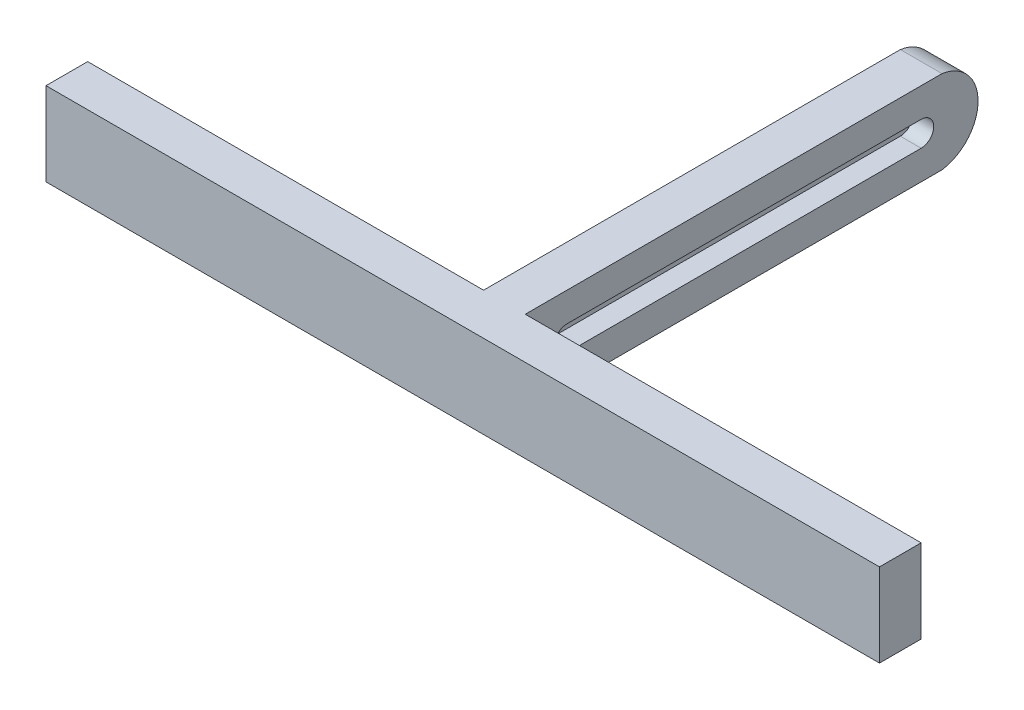
ISO-10303-21;
HEADER;
FILE_DESCRIPTION(('STEP AP214'),'2;1');
FILE_NAME('part.step','',(''),(''),'','','');
FILE_SCHEMA(('AUTOMOTIVE_DESIGN { 1 0 10303 214 1 1 1 1 }'));
ENDSEC;
DATA;
#1=APPLICATION_CONTEXT('core data for automotive mechanical design processes');
#2=APPLICATION_PROTOCOL_DEFINITION('international standard','automotive_design',2000,#1);
#3=PRODUCT_CONTEXT('',#1,'mechanical');
#4=PRODUCT('Part','Part','',(#3));
#5=PRODUCT_RELATED_PRODUCT_CATEGORY('part','',(#4));
#6=PRODUCT_DEFINITION_FORMATION('','',#4);
#7=PRODUCT_DEFINITION_CONTEXT('part definition',#1,'design');
#8=PRODUCT_DEFINITION('design','',#6,#7);
#9=PRODUCT_DEFINITION_SHAPE('','',#8);
#10=(LENGTH_UNIT() NAMED_UNIT(*) SI_UNIT(.MILLI.,.METRE.));
#11=(NAMED_UNIT(*) PLANE_ANGLE_UNIT() SI_UNIT($,.RADIAN.));
#12=(NAMED_UNIT(*) SI_UNIT($,.STERADIAN.) SOLID_ANGLE_UNIT());
#13=UNCERTAINTY_MEASURE_WITH_UNIT(LENGTH_MEASURE(1.E-05),#10,'distance_accuracy_value','');
#14=(GEOMETRIC_REPRESENTATION_CONTEXT(3) GLOBAL_UNCERTAINTY_ASSIGNED_CONTEXT((#13)) GLOBAL_UNIT_ASSIGNED_CONTEXT((#10,
#11,#12)) REPRESENTATION_CONTEXT('',''));
#15=CARTESIAN_POINT('',(0.,0.,0.));
#16=DIRECTION('',(0.,0.,1.));
#17=DIRECTION('',(1.,0.,0.));
#18=AXIS2_PLACEMENT_3D('',#15,#16,#17);
#19=CARTESIAN_POINT('',(5.,-10.,50.));
#20=DIRECTION('',(0.,1.,0.));
#21=DIRECTION('',(0.,0.,1.));
#22=AXIS2_PLACEMENT_3D('',#19,#20,#21);
#23=PLANE('',#22);
#24=DIRECTION('',(0.,0.,-1.));
#25=VECTOR('',#24,1.);
#26=CARTESIAN_POINT('',(-5.,-10.,50.));
#27=LINE('',#26,#25);
#28=CARTESIAN_POINT('',(-5.,-10.,50.));
#29=VERTEX_POINT('',#28);
#30=CARTESIAN_POINT('',(-5.,-10.,-50.));
#31=VERTEX_POINT('',#30);
#32=EDGE_CURVE('E228',#29,#31,#27,.T.);
#33=ORIENTED_EDGE('',*,*,#32,.T.);
#34=DIRECTION('',(-1.,0.,0.));
#35=VECTOR('',#34,1.);
#36=CARTESIAN_POINT('',(5.,-10.,-50.));
#37=LINE('',#36,#35);
#38=CARTESIAN_POINT('',(5.,-10.,-50.));
#39=VERTEX_POINT('',#38);
#40=EDGE_CURVE('E11',#39,#31,#37,.T.);
#41=ORIENTED_EDGE('',*,*,#40,.F.);
#42=DIRECTION('',(0.,0.,-1.));
#43=VECTOR('',#42,1.);
#44=CARTESIAN_POINT('',(5.,-10.,50.));
#45=LINE('',#44,#43);
#46=CARTESIAN_POINT('',(5.,-10.,50.));
#47=VERTEX_POINT('',#46);
#48=EDGE_CURVE('E218',#47,#39,#45,.T.);
#49=ORIENTED_EDGE('',*,*,#48,.F.);
#50=DIRECTION('',(-1.,0.,0.));
#51=VECTOR('',#50,1.);
#52=CARTESIAN_POINT('',(100.,-10.,50.));
#53=LINE('',#52,#51);
#54=CARTESIAN_POINT('',(100.,-10.,50.));
#55=VERTEX_POINT('',#54);
#56=EDGE_CURVE('E69',#55,#47,#53,.T.);
#57=ORIENTED_EDGE('',*,*,#56,.F.);
#58=DIRECTION('',(0.,0.,-1.));
#59=VECTOR('',#58,1.);
#60=CARTESIAN_POINT('',(100.,-10.,50.));
#61=LINE('',#60,#59);
#62=CARTESIAN_POINT('',(100.,-10.,60.));
#63=VERTEX_POINT('',#62);
#64=EDGE_CURVE('E152',#63,#55,#61,.T.);
#65=ORIENTED_EDGE('',*,*,#64,.F.);
#66=DIRECTION('',(-1.,0.,0.));
#67=VECTOR('',#66,1.);
#68=CARTESIAN_POINT('',(100.,-10.,60.));
#69=LINE('',#68,#67);
#70=CARTESIAN_POINT('',(-100.,-10.,60.));
#71=VERTEX_POINT('',#70);
#72=EDGE_CURVE('E257',#63,#71,#69,.T.);
#73=ORIENTED_EDGE('',*,*,#72,.T.);
#74=DIRECTION('',(0.,0.,-1.));
#75=VECTOR('',#74,1.);
#76=CARTESIAN_POINT('',(-100.,-10.,50.));
#77=LINE('',#76,#75);
#78=CARTESIAN_POINT('',(-100.,-10.,50.));
#79=VERTEX_POINT('',#78);
#80=EDGE_CURVE('E154',#71,#79,#77,.T.);
#81=ORIENTED_EDGE('',*,*,#80,.T.);
#82=EDGE_CURVE('E246',#29,#79,#53,.T.);
#83=ORIENTED_EDGE('',*,*,#82,.F.);
#84=EDGE_LOOP('',(#33,#41,#49,#57,#65,#73,#81,#83));
#85=FACE_BOUND('',#84,.T.);
#86=ADVANCED_FACE('F45',(#85),#23,.F.);
#87=CARTESIAN_POINT('',(5.,10.,50.));
#88=DIRECTION('',(0.,-1.,0.));
#89=DIRECTION('',(0.,0.,-1.));
#90=AXIS2_PLACEMENT_3D('',#87,#88,#89);
#91=PLANE('',#90);
#92=DIRECTION('',(0.,0.,1.));
#93=VECTOR('',#92,1.);
#94=CARTESIAN_POINT('',(-5.,10.,50.));
#95=LINE('',#94,#93);
#96=CARTESIAN_POINT('',(-5.,10.,-50.));
#97=VERTEX_POINT('',#96);
#98=CARTESIAN_POINT('',(-5.,10.,50.));
#99=VERTEX_POINT('',#98);
#100=EDGE_CURVE('E219',#97,#99,#95,.T.);
#101=ORIENTED_EDGE('',*,*,#100,.T.);
#102=DIRECTION('',(-1.,0.,0.));
#103=VECTOR('',#102,1.);
#104=CARTESIAN_POINT('',(100.,10.,50.));
#105=LINE('',#104,#103);
#106=CARTESIAN_POINT('',(-100.,10.,50.));
#107=VERTEX_POINT('',#106);
#108=EDGE_CURVE('E160',#99,#107,#105,.T.);
#109=ORIENTED_EDGE('',*,*,#108,.T.);
#110=DIRECTION('',(0.,0.,1.));
#111=VECTOR('',#110,1.);
#112=CARTESIAN_POINT('',(-100.,10.,50.));
#113=LINE('',#112,#111);
#114=CARTESIAN_POINT('',(-100.,10.,60.));
#115=VERTEX_POINT('',#114);
#116=EDGE_CURVE('E271',#107,#115,#113,.T.);
#117=ORIENTED_EDGE('',*,*,#116,.T.);
#118=DIRECTION('',(-1.,0.,0.));
#119=VECTOR('',#118,1.);
#120=CARTESIAN_POINT('',(100.,10.,60.));
#121=LINE('',#120,#119);
#122=CARTESIAN_POINT('',(100.,10.,60.));
#123=VERTEX_POINT('',#122);
#124=EDGE_CURVE('E143',#123,#115,#121,.T.);
#125=ORIENTED_EDGE('',*,*,#124,.F.);
#126=DIRECTION('',(0.,0.,1.));
#127=VECTOR('',#126,1.);
#128=CARTESIAN_POINT('',(100.,10.,50.));
#129=LINE('',#128,#127);
#130=CARTESIAN_POINT('',(100.,10.,50.));
#131=VERTEX_POINT('',#130);
#132=EDGE_CURVE('E134',#131,#123,#129,.T.);
#133=ORIENTED_EDGE('',*,*,#132,.F.);
#134=CARTESIAN_POINT('',(5.,10.,50.));
#135=VERTEX_POINT('',#134);
#136=EDGE_CURVE('E140',#131,#135,#105,.T.);
#137=ORIENTED_EDGE('',*,*,#136,.T.);
#138=DIRECTION('',(0.,0.,1.));
#139=VECTOR('',#138,1.);
#140=CARTESIAN_POINT('',(5.,10.,50.));
#141=LINE('',#140,#139);
#142=CARTESIAN_POINT('',(5.,10.,-50.));
#143=VERTEX_POINT('',#142);
#144=EDGE_CURVE('E223',#143,#135,#141,.T.);
#145=ORIENTED_EDGE('',*,*,#144,.F.);
#146=DIRECTION('',(-1.,0.,0.));
#147=VECTOR('',#146,1.);
#148=CARTESIAN_POINT('',(5.,10.,-50.));
#149=LINE('',#148,#147);
#150=EDGE_CURVE('E53',#143,#97,#149,.T.);
#151=ORIENTED_EDGE('',*,*,#150,.T.);
#152=EDGE_LOOP('',(#101,#109,#117,#125,#133,#137,#145,#151));
#153=FACE_BOUND('',#152,.T.);
#154=ADVANCED_FACE('F137',(#153),#91,.F.);
#155=CARTESIAN_POINT('',(5.,0.,0.));
#156=DIRECTION('',(1.,0.,0.));
#157=DIRECTION('',(0.,0.,-1.));
#158=AXIS2_PLACEMENT_3D('',#155,#156,#157);
#159=PLANE('',#158);
#160=CARTESIAN_POINT('',(5.,0.,40.));
#161=DIRECTION('',(1.,0.,0.));
#162=DIRECTION('',(0.,0.,-1.));
#163=AXIS2_PLACEMENT_3D('',#160,#161,#162);
#164=CIRCLE('',#163,3.);
#165=CARTESIAN_POINT('',(5.,3.,40.));
#166=VERTEX_POINT('',#165);
#167=CARTESIAN_POINT('',(5.,-3.,40.));
#168=VERTEX_POINT('',#167);
#169=EDGE_CURVE('E60',#166,#168,#164,.T.);
#170=ORIENTED_EDGE('',*,*,#169,.F.);
#171=DIRECTION('',(0.,0.,1.));
#172=VECTOR('',#171,1.);
#173=CARTESIAN_POINT('',(5.,3.,40.));
#174=LINE('',#173,#172);
#175=CARTESIAN_POINT('',(5.,3.,-45.));
#176=VERTEX_POINT('',#175);
#177=EDGE_CURVE('E174',#176,#166,#174,.T.);
#178=ORIENTED_EDGE('',*,*,#177,.F.);
#179=CARTESIAN_POINT('',(5.,0.,-45.));
#180=DIRECTION('',(1.,0.,0.));
#181=DIRECTION('',(0.,0.,1.));
#182=AXIS2_PLACEMENT_3D('',#179,#180,#181);
#183=CIRCLE('',#182,3.);
#184=CARTESIAN_POINT('',(5.,-3.,-45.));
#185=VERTEX_POINT('',#184);
#186=EDGE_CURVE('E190',#185,#176,#183,.T.);
#187=ORIENTED_EDGE('',*,*,#186,.F.);
#188=DIRECTION('',(0.,0.,-1.));
#189=VECTOR('',#188,1.);
#190=CARTESIAN_POINT('',(5.,-3.,40.));
#191=LINE('',#190,#189);
#192=EDGE_CURVE('E164',#168,#185,#191,.T.);
#193=ORIENTED_EDGE('',*,*,#192,.F.);
#194=EDGE_LOOP('',(#170,#178,#187,#193));
#195=FACE_BOUND('',#194,.T.);
#196=ORIENTED_EDGE('',*,*,#48,.T.);
#197=CARTESIAN_POINT('',(5.,0.,-48.555144550315));
#198=DIRECTION('',(-1.,0.,0.));
#199=DIRECTION('',(0.,0.,1.));
#200=AXIS2_PLACEMENT_3D('',#197,#198,#199);
#201=CIRCLE('',#200,10.1038412136417);
#202=EDGE_CURVE('E209',#143,#39,#201,.T.);
#203=ORIENTED_EDGE('',*,*,#202,.F.);
#204=ORIENTED_EDGE('',*,*,#144,.T.);
#205=DIRECTION('',(0.,-1.,0.));
#206=VECTOR('',#205,1.);
#207=CARTESIAN_POINT('',(5.,10.,50.));
#208=LINE('',#207,#206);
#209=EDGE_CURVE('E158',#135,#47,#208,.T.);
#210=ORIENTED_EDGE('',*,*,#209,.T.);
#211=EDGE_LOOP('',(#196,#203,#204,#210));
#212=FACE_BOUND('',#211,.T.);
#213=ADVANCED_FACE('F282',(#195,#212),#159,.T.);
#214=CARTESIAN_POINT('',(-5.,0.,0.));
#215=DIRECTION('',(1.,0.,0.));
#216=DIRECTION('',(0.,0.,-1.));
#217=AXIS2_PLACEMENT_3D('',#214,#215,#216);
#218=PLANE('',#217);
#219=ORIENTED_EDGE('',*,*,#100,.F.);
#220=CARTESIAN_POINT('',(-5.,0.,-48.555144550315));
#221=DIRECTION('',(-1.,0.,0.));
#222=DIRECTION('',(0.,0.,1.));
#223=AXIS2_PLACEMENT_3D('',#220,#221,#222);
#224=CIRCLE('',#223,10.1038412136417);
#225=EDGE_CURVE('E200',#97,#31,#224,.T.);
#226=ORIENTED_EDGE('',*,*,#225,.T.);
#227=ORIENTED_EDGE('',*,*,#32,.F.);
#228=DIRECTION('',(0.,-1.,0.));
#229=VECTOR('',#228,1.);
#230=CARTESIAN_POINT('',(-5.,10.,50.));
#231=LINE('',#230,#229);
#232=EDGE_CURVE('E212',#99,#29,#231,.T.);
#233=ORIENTED_EDGE('',*,*,#232,.F.);
#234=EDGE_LOOP('',(#219,#226,#227,#233));
#235=FACE_BOUND('',#234,.T.);
#236=ADVANCED_FACE('F240',(#235),#218,.F.);
#237=CARTESIAN_POINT('',(5.,0.,-48.555144550315));
#238=DIRECTION('',(-1.,0.,0.));
#239=DIRECTION('',(0.,0.,1.));
#240=AXIS2_PLACEMENT_3D('',#237,#238,#239);
#241=CYLINDRICAL_SURFACE('',#240,10.1038412136417);
#242=ORIENTED_EDGE('',*,*,#225,.F.);
#243=ORIENTED_EDGE('',*,*,#150,.F.);
#244=ORIENTED_EDGE('',*,*,#202,.T.);
#245=ORIENTED_EDGE('',*,*,#40,.T.);
#246=EDGE_LOOP('',(#242,#243,#244,#245));
#247=FACE_BOUND('',#246,.T.);
#248=ADVANCED_FACE('F283',(#247),#241,.T.);
#249=CARTESIAN_POINT('',(0.,0.,40.));
#250=DIRECTION('',(1.,0.,0.));
#251=DIRECTION('',(0.,0.,-1.));
#252=AXIS2_PLACEMENT_3D('',#249,#250,#251);
#253=CYLINDRICAL_SURFACE('',#252,3.);
#254=ORIENTED_EDGE('',*,*,#169,.T.);
#255=DIRECTION('',(1.,0.,0.));
#256=VECTOR('',#255,1.);
#257=CARTESIAN_POINT('',(0.,-3.,40.));
#258=LINE('',#257,#256);
#259=CARTESIAN_POINT('',(0.,-3.,40.));
#260=VERTEX_POINT('',#259);
#261=EDGE_CURVE('E185',#260,#168,#258,.T.);
#262=ORIENTED_EDGE('',*,*,#261,.F.);
#263=CARTESIAN_POINT('',(0.,0.,40.));
#264=DIRECTION('',(1.,0.,0.));
#265=DIRECTION('',(0.,0.,-1.));
#266=AXIS2_PLACEMENT_3D('',#263,#264,#265);
#267=CIRCLE('',#266,3.);
#268=CARTESIAN_POINT('',(0.,3.,40.));
#269=VERTEX_POINT('',#268);
#270=EDGE_CURVE('E169',#269,#260,#267,.T.);
#271=ORIENTED_EDGE('',*,*,#270,.F.);
#272=DIRECTION('',(1.,0.,0.));
#273=VECTOR('',#272,1.);
#274=CARTESIAN_POINT('',(0.,3.,40.));
#275=LINE('',#274,#273);
#276=EDGE_CURVE('E197',#269,#166,#275,.T.);
#277=ORIENTED_EDGE('',*,*,#276,.T.);
#278=EDGE_LOOP('',(#254,#262,#271,#277));
#279=FACE_BOUND('',#278,.T.);
#280=ADVANCED_FACE('F285',(#279),#253,.F.);
#281=CARTESIAN_POINT('',(0.,3.,40.));
#282=DIRECTION('',(0.,1.,0.));
#283=DIRECTION('',(0.,0.,1.));
#284=AXIS2_PLACEMENT_3D('',#281,#282,#283);
#285=PLANE('',#284);
#286=ORIENTED_EDGE('',*,*,#177,.T.);
#287=ORIENTED_EDGE('',*,*,#276,.F.);
#288=DIRECTION('',(0.,0.,1.));
#289=VECTOR('',#288,1.);
#290=CARTESIAN_POINT('',(0.,3.,40.));
#291=LINE('',#290,#289);
#292=CARTESIAN_POINT('',(0.,3.,-45.));
#293=VERTEX_POINT('',#292);
#294=EDGE_CURVE('E182',#293,#269,#291,.T.);
#295=ORIENTED_EDGE('',*,*,#294,.F.);
#296=DIRECTION('',(1.,0.,0.));
#297=VECTOR('',#296,1.);
#298=CARTESIAN_POINT('',(0.,3.,-45.));
#299=LINE('',#298,#297);
#300=EDGE_CURVE('E201',#293,#176,#299,.T.);
#301=ORIENTED_EDGE('',*,*,#300,.T.);
#302=EDGE_LOOP('',(#286,#287,#295,#301));
#303=FACE_BOUND('',#302,.T.);
#304=ADVANCED_FACE('F291',(#303),#285,.F.);
#305=CARTESIAN_POINT('',(0.,0.,-45.));
#306=DIRECTION('',(1.,0.,0.));
#307=DIRECTION('',(0.,0.,-1.));
#308=AXIS2_PLACEMENT_3D('',#305,#306,#307);
#309=CYLINDRICAL_SURFACE('',#308,3.);
#310=ORIENTED_EDGE('',*,*,#186,.T.);
#311=ORIENTED_EDGE('',*,*,#300,.F.);
#312=CARTESIAN_POINT('',(0.,0.,-45.));
#313=DIRECTION('',(1.,0.,0.));
#314=DIRECTION('',(0.,0.,1.));
#315=AXIS2_PLACEMENT_3D('',#312,#313,#314);
#316=CIRCLE('',#315,3.);
#317=CARTESIAN_POINT('',(0.,-3.,-45.));
#318=VERTEX_POINT('',#317);
#319=EDGE_CURVE('E178',#318,#293,#316,.T.);
#320=ORIENTED_EDGE('',*,*,#319,.F.);
#321=DIRECTION('',(1.,0.,0.));
#322=VECTOR('',#321,1.);
#323=CARTESIAN_POINT('',(0.,-3.,-45.));
#324=LINE('',#323,#322);
#325=EDGE_CURVE('E204',#318,#185,#324,.T.);
#326=ORIENTED_EDGE('',*,*,#325,.T.);
#327=EDGE_LOOP('',(#310,#311,#320,#326));
#328=FACE_BOUND('',#327,.T.);
#329=ADVANCED_FACE('F318',(#328),#309,.F.);
#330=CARTESIAN_POINT('',(0.,-3.,40.));
#331=DIRECTION('',(0.,-1.,0.));
#332=DIRECTION('',(0.,0.,-1.));
#333=AXIS2_PLACEMENT_3D('',#330,#331,#332);
#334=PLANE('',#333);
#335=ORIENTED_EDGE('',*,*,#192,.T.);
#336=ORIENTED_EDGE('',*,*,#325,.F.);
#337=DIRECTION('',(0.,0.,-1.));
#338=VECTOR('',#337,1.);
#339=CARTESIAN_POINT('',(0.,-3.,40.));
#340=LINE('',#339,#338);
#341=EDGE_CURVE('E173',#260,#318,#340,.T.);
#342=ORIENTED_EDGE('',*,*,#341,.F.);
#343=ORIENTED_EDGE('',*,*,#261,.T.);
#344=EDGE_LOOP('',(#335,#336,#342,#343));
#345=FACE_BOUND('',#344,.T.);
#346=ADVANCED_FACE('F309',(#345),#334,.F.);
#347=CARTESIAN_POINT('',(0.,0.,40.));
#348=DIRECTION('',(1.,0.,0.));
#349=DIRECTION('',(0.,0.,-1.));
#350=AXIS2_PLACEMENT_3D('',#347,#348,#349);
#351=PLANE('',#350);
#352=ORIENTED_EDGE('',*,*,#270,.T.);
#353=ORIENTED_EDGE('',*,*,#341,.T.);
#354=ORIENTED_EDGE('',*,*,#319,.T.);
#355=ORIENTED_EDGE('',*,*,#294,.T.);
#356=EDGE_LOOP('',(#352,#353,#354,#355));
#357=FACE_BOUND('',#356,.T.);
#358=ADVANCED_FACE('F315',(#357),#351,.T.);
#359=CARTESIAN_POINT('',(100.,10.,50.));
#360=DIRECTION('',(0.,0.,1.));
#361=DIRECTION('',(1.,0.,0.));
#362=AXIS2_PLACEMENT_3D('',#359,#360,#361);
#363=PLANE('',#362);
#364=ORIENTED_EDGE('',*,*,#108,.F.);
#365=ORIENTED_EDGE('',*,*,#232,.T.);
#366=ORIENTED_EDGE('',*,*,#82,.T.);
#367=DIRECTION('',(0.,1.,0.));
#368=VECTOR('',#367,1.);
#369=CARTESIAN_POINT('',(-100.,10.,50.));
#370=LINE('',#369,#368);
#371=EDGE_CURVE('E275',#79,#107,#370,.T.);
#372=ORIENTED_EDGE('',*,*,#371,.T.);
#373=EDGE_LOOP('',(#364,#365,#366,#372));
#374=FACE_BOUND('',#373,.T.);
#375=ADVANCED_FACE('F244',(#374),#363,.F.);
#376=ORIENTED_EDGE('',*,*,#209,.F.);
#377=ORIENTED_EDGE('',*,*,#136,.F.);
#378=DIRECTION('',(0.,1.,0.));
#379=VECTOR('',#378,1.);
#380=CARTESIAN_POINT('',(100.,10.,50.));
#381=LINE('',#380,#379);
#382=EDGE_CURVE('E148',#55,#131,#381,.T.);
#383=ORIENTED_EDGE('',*,*,#382,.F.);
#384=ORIENTED_EDGE('',*,*,#56,.T.);
#385=EDGE_LOOP('',(#376,#377,#383,#384));
#386=FACE_BOUND('',#385,.T.);
#387=ADVANCED_FACE('F156',(#386),#363,.F.);
#388=CARTESIAN_POINT('',(100.,10.,60.));
#389=DIRECTION('',(0.,0.,-1.));
#390=DIRECTION('',(-1.,0.,0.));
#391=AXIS2_PLACEMENT_3D('',#388,#389,#390);
#392=PLANE('',#391);
#393=DIRECTION('',(0.,-1.,0.));
#394=VECTOR('',#393,1.);
#395=CARTESIAN_POINT('',(-100.,10.,60.));
#396=LINE('',#395,#394);
#397=EDGE_CURVE('E267',#115,#71,#396,.T.);
#398=ORIENTED_EDGE('',*,*,#397,.T.);
#399=ORIENTED_EDGE('',*,*,#72,.F.);
#400=DIRECTION('',(0.,-1.,0.));
#401=VECTOR('',#400,1.);
#402=CARTESIAN_POINT('',(100.,10.,60.));
#403=LINE('',#402,#401);
#404=EDGE_CURVE('E147',#123,#63,#403,.T.);
#405=ORIENTED_EDGE('',*,*,#404,.F.);
#406=ORIENTED_EDGE('',*,*,#124,.T.);
#407=EDGE_LOOP('',(#398,#399,#405,#406));
#408=FACE_BOUND('',#407,.T.);
#409=ADVANCED_FACE('F266',(#408),#392,.F.);
#410=CARTESIAN_POINT('',(100.,0.,0.));
#411=DIRECTION('',(-1.,0.,0.));
#412=DIRECTION('',(0.,0.,1.));
#413=AXIS2_PLACEMENT_3D('',#410,#411,#412);
#414=PLANE('',#413);
#415=ORIENTED_EDGE('',*,*,#382,.T.);
#416=ORIENTED_EDGE('',*,*,#132,.T.);
#417=ORIENTED_EDGE('',*,*,#404,.T.);
#418=ORIENTED_EDGE('',*,*,#64,.T.);
#419=EDGE_LOOP('',(#415,#416,#417,#418));
#420=FACE_BOUND('',#419,.T.);
#421=ADVANCED_FACE('F150',(#420),#414,.F.);
#422=CARTESIAN_POINT('',(-100.,0.,0.));
#423=DIRECTION('',(-1.,0.,0.));
#424=DIRECTION('',(0.,0.,1.));
#425=AXIS2_PLACEMENT_3D('',#422,#423,#424);
#426=PLANE('',#425);
#427=ORIENTED_EDGE('',*,*,#371,.F.);
#428=ORIENTED_EDGE('',*,*,#80,.F.);
#429=ORIENTED_EDGE('',*,*,#397,.F.);
#430=ORIENTED_EDGE('',*,*,#116,.F.);
#431=EDGE_LOOP('',(#427,#428,#429,#430));
#432=FACE_BOUND('',#431,.T.);
#433=ADVANCED_FACE('F270',(#432),#426,.T.);
#434=CLOSED_SHELL('',(#86,#154,#213,#236,#248,#280,#304,#329,#346,#358,#375,#387,#409,#421,#433));
#435=MANIFOLD_SOLID_BREP('B2',#434);
#436=ADVANCED_BREP_SHAPE_REPRESENTATION('',(#18,#435),#14);
#437=SHAPE_DEFINITION_REPRESENTATION(#9,#436);
ENDSEC;
END-ISO-10303-21;
